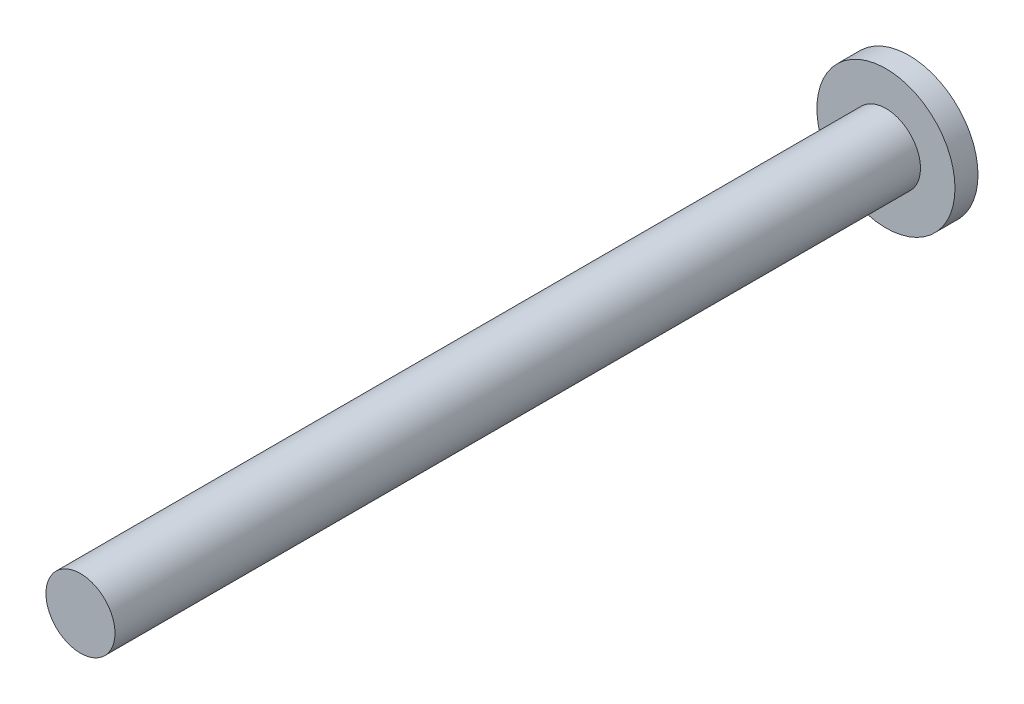
ISO-10303-21;
HEADER;
FILE_DESCRIPTION(('STEP AP214'),'2;1');
FILE_NAME('part.step','',(''),(''),'','','');
FILE_SCHEMA(('AUTOMOTIVE_DESIGN { 1 0 10303 214 1 1 1 1 }'));
ENDSEC;
DATA;
#1=APPLICATION_CONTEXT('core data for automotive mechanical design processes');
#2=APPLICATION_PROTOCOL_DEFINITION('international standard','automotive_design',2000,#1);
#3=PRODUCT_CONTEXT('',#1,'mechanical');
#4=PRODUCT('Part','Part','',(#3));
#5=PRODUCT_RELATED_PRODUCT_CATEGORY('part','',(#4));
#6=PRODUCT_DEFINITION_FORMATION('','',#4);
#7=PRODUCT_DEFINITION_CONTEXT('part definition',#1,'design');
#8=PRODUCT_DEFINITION('design','',#6,#7);
#9=PRODUCT_DEFINITION_SHAPE('','',#8);
#10=(LENGTH_UNIT() NAMED_UNIT(*) SI_UNIT(.MILLI.,.METRE.));
#11=(NAMED_UNIT(*) PLANE_ANGLE_UNIT() SI_UNIT($,.RADIAN.));
#12=(NAMED_UNIT(*) SI_UNIT($,.STERADIAN.) SOLID_ANGLE_UNIT());
#13=UNCERTAINTY_MEASURE_WITH_UNIT(LENGTH_MEASURE(1.E-05),#10,'distance_accuracy_value','');
#14=(GEOMETRIC_REPRESENTATION_CONTEXT(3) GLOBAL_UNCERTAINTY_ASSIGNED_CONTEXT((#13)) GLOBAL_UNIT_ASSIGNED_CONTEXT((#10,
#11,#12)) REPRESENTATION_CONTEXT('',''));
#15=CARTESIAN_POINT('',(0.,0.,0.));
#16=DIRECTION('',(0.,0.,1.));
#17=DIRECTION('',(1.,0.,0.));
#18=AXIS2_PLACEMENT_3D('',#15,#16,#17);
#19=CARTESIAN_POINT('',(0.,0.,35.));
#20=DIRECTION('',(0.,0.,-1.));
#21=DIRECTION('',(-1.,0.,0.));
#22=AXIS2_PLACEMENT_3D('',#19,#20,#21);
#23=CYLINDRICAL_SURFACE('',#22,1.5);
#24=CARTESIAN_POINT('',(0.,0.,35.));
#25=DIRECTION('',(0.,0.,1.));
#26=DIRECTION('',(1.,0.,0.));
#27=AXIS2_PLACEMENT_3D('',#24,#25,#26);
#28=CIRCLE('',#27,1.5);
#29=CARTESIAN_POINT('',(1.5,0.,35.));
#30=VERTEX_POINT('',#29);
#31=EDGE_CURVE('E10',#30,#30,#28,.T.);
#32=ORIENTED_EDGE('',*,*,#31,.F.);
#33=EDGE_LOOP('',(#32));
#34=FACE_BOUND('',#33,.T.);
#35=CARTESIAN_POINT('',(0.,0.,0.));
#36=DIRECTION('',(0.,0.,1.));
#37=DIRECTION('',(1.,0.,0.));
#38=AXIS2_PLACEMENT_3D('',#35,#36,#37);
#39=CIRCLE('',#38,1.5);
#40=CARTESIAN_POINT('',(1.5,0.,0.));
#41=VERTEX_POINT('',#40);
#42=EDGE_CURVE('E39',#41,#41,#39,.T.);
#43=ORIENTED_EDGE('',*,*,#42,.T.);
#44=EDGE_LOOP('',(#43));
#45=FACE_BOUND('',#44,.T.);
#46=ADVANCED_FACE('F33',(#34,#45),#23,.T.);
#47=CARTESIAN_POINT('',(0.,0.,35.));
#48=DIRECTION('',(0.,0.,1.));
#49=DIRECTION('',(1.,0.,0.));
#50=AXIS2_PLACEMENT_3D('',#47,#48,#49);
#51=PLANE('',#50);
#52=ORIENTED_EDGE('',*,*,#31,.T.);
#53=EDGE_LOOP('',(#52));
#54=FACE_BOUND('',#53,.T.);
#55=ADVANCED_FACE('F67',(#54),#51,.T.);
#56=CARTESIAN_POINT('',(0.,0.,0.));
#57=DIRECTION('',(0.,0.,1.));
#58=DIRECTION('',(1.,0.,0.));
#59=AXIS2_PLACEMENT_3D('',#56,#57,#58);
#60=PLANE('',#59);
#61=CARTESIAN_POINT('',(0.,0.,0.));
#62=DIRECTION('',(0.,0.,1.));
#63=DIRECTION('',(1.,0.,0.));
#64=AXIS2_PLACEMENT_3D('',#61,#62,#63);
#65=CIRCLE('',#64,3.);
#66=CARTESIAN_POINT('',(3.,0.,0.));
#67=VERTEX_POINT('',#66);
#68=EDGE_CURVE('E47',#67,#67,#65,.T.);
#69=ORIENTED_EDGE('',*,*,#68,.T.);
#70=EDGE_LOOP('',(#69));
#71=FACE_BOUND('',#70,.T.);
#72=ORIENTED_EDGE('',*,*,#42,.F.);
#73=EDGE_LOOP('',(#72));
#74=FACE_BOUND('',#73,.T.);
#75=ADVANCED_FACE('F53',(#71,#74),#60,.T.);
#76=CARTESIAN_POINT('',(0.,0.,-1.));
#77=DIRECTION('',(0.,0.,1.));
#78=DIRECTION('',(1.,0.,0.));
#79=AXIS2_PLACEMENT_3D('',#76,#77,#78);
#80=CYLINDRICAL_SURFACE('',#79,3.);
#81=CARTESIAN_POINT('',(0.,0.,-1.));
#82=DIRECTION('',(0.,0.,1.));
#83=DIRECTION('',(1.,0.,0.));
#84=AXIS2_PLACEMENT_3D('',#81,#82,#83);
#85=CIRCLE('',#84,3.);
#86=CARTESIAN_POINT('',(3.,0.,-1.));
#87=VERTEX_POINT('',#86);
#88=EDGE_CURVE('E43',#87,#87,#85,.T.);
#89=ORIENTED_EDGE('',*,*,#88,.T.);
#90=EDGE_LOOP('',(#89));
#91=FACE_BOUND('',#90,.T.);
#92=ORIENTED_EDGE('',*,*,#68,.F.);
#93=EDGE_LOOP('',(#92));
#94=FACE_BOUND('',#93,.T.);
#95=ADVANCED_FACE('F56',(#91,#94),#80,.T.);
#96=CARTESIAN_POINT('',(0.,0.,-1.));
#97=DIRECTION('',(0.,0.,1.));
#98=DIRECTION('',(1.,0.,0.));
#99=AXIS2_PLACEMENT_3D('',#96,#97,#98);
#100=PLANE('',#99);
#101=ORIENTED_EDGE('',*,*,#88,.F.);
#102=EDGE_LOOP('',(#101));
#103=FACE_BOUND('',#102,.T.);
#104=ADVANCED_FACE('F58',(#103),#100,.F.);
#105=CLOSED_SHELL('',(#46,#55,#75,#95,#104));
#106=MANIFOLD_SOLID_BREP('B2',#105);
#107=ADVANCED_BREP_SHAPE_REPRESENTATION('',(#18,#106),#14);
#108=SHAPE_DEFINITION_REPRESENTATION(#9,#107);
ENDSEC;
END-ISO-10303-21;
